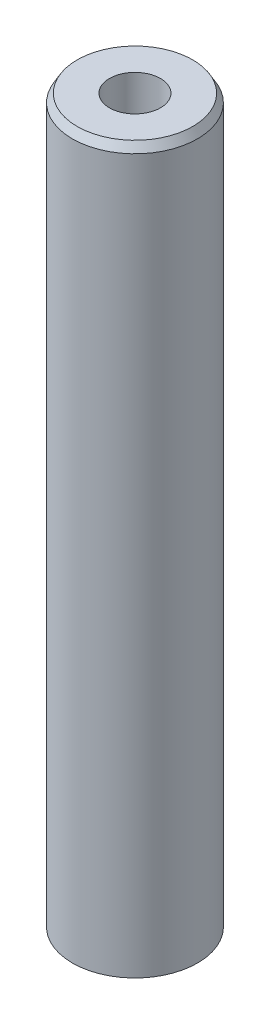
ISO-10303-21;
HEADER;
FILE_DESCRIPTION(('STEP AP214'),'2;1');
FILE_NAME('part.step','',(''),(''),'','','');
FILE_SCHEMA(('AUTOMOTIVE_DESIGN { 1 0 10303 214 1 1 1 1 }'));
ENDSEC;
DATA;
#1=APPLICATION_CONTEXT('core data for automotive mechanical design processes');
#2=APPLICATION_PROTOCOL_DEFINITION('international standard','automotive_design',2000,#1);
#3=PRODUCT_CONTEXT('',#1,'mechanical');
#4=PRODUCT('Part','Part','',(#3));
#5=PRODUCT_RELATED_PRODUCT_CATEGORY('part','',(#4));
#6=PRODUCT_DEFINITION_FORMATION('','',#4);
#7=PRODUCT_DEFINITION_CONTEXT('part definition',#1,'design');
#8=PRODUCT_DEFINITION('design','',#6,#7);
#9=PRODUCT_DEFINITION_SHAPE('','',#8);
#10=(LENGTH_UNIT() NAMED_UNIT(*) SI_UNIT(.MILLI.,.METRE.));
#11=(NAMED_UNIT(*) PLANE_ANGLE_UNIT() SI_UNIT($,.RADIAN.));
#12=(NAMED_UNIT(*) SI_UNIT($,.STERADIAN.) SOLID_ANGLE_UNIT());
#13=UNCERTAINTY_MEASURE_WITH_UNIT(LENGTH_MEASURE(1.E-05),#10,'distance_accuracy_value','');
#14=(GEOMETRIC_REPRESENTATION_CONTEXT(3) GLOBAL_UNCERTAINTY_ASSIGNED_CONTEXT((#13)) GLOBAL_UNIT_ASSIGNED_CONTEXT((#10,
#11,#12)) REPRESENTATION_CONTEXT('',''));
#15=CARTESIAN_POINT('',(0.,0.,0.));
#16=DIRECTION('',(0.,0.,1.));
#17=DIRECTION('',(1.,0.,0.));
#18=AXIS2_PLACEMENT_3D('',#15,#16,#17);
#19=CARTESIAN_POINT('',(0.,203.347318659186,0.));
#20=DIRECTION('',(0.,-1.,0.));
#21=DIRECTION('',(0.,0.,-1.));
#22=AXIS2_PLACEMENT_3D('',#19,#20,#21);
#23=CYLINDRICAL_SURFACE('',#22,17.5);
#24=CARTESIAN_POINT('',(0.,201.023777022342,0.));
#25=DIRECTION('',(0.,1.,0.));
#26=DIRECTION('',(0.,0.,1.));
#27=AXIS2_PLACEMENT_3D('',#24,#25,#26);
#28=CIRCLE('',#27,17.5);
#29=CARTESIAN_POINT('',(0.,201.023777022342,17.5));
#30=VERTEX_POINT('',#29);
#31=EDGE_CURVE('E50',#30,#30,#28,.F.);
#32=ORIENTED_EDGE('',*,*,#31,.T.);
#33=EDGE_LOOP('',(#32));
#34=FACE_BOUND('',#33,.T.);
#35=CARTESIAN_POINT('',(0.,1.34149738950504,0.));
#36=DIRECTION('',(0.,1.,0.));
#37=DIRECTION('',(0.,0.,1.));
#38=AXIS2_PLACEMENT_3D('',#35,#36,#37);
#39=CIRCLE('',#38,17.5);
#40=CARTESIAN_POINT('',(0.,1.34149738950504,17.5));
#41=VERTEX_POINT('',#40);
#42=EDGE_CURVE('E51',#41,#41,#39,.T.);
#43=ORIENTED_EDGE('',*,*,#42,.T.);
#44=EDGE_LOOP('',(#43));
#45=FACE_BOUND('',#44,.T.);
#46=ADVANCED_FACE('F39',(#34,#45),#23,.T.);
#47=CARTESIAN_POINT('',(0.,203.347318659186,0.));
#48=DIRECTION('',(0.,1.,0.));
#49=DIRECTION('',(0.,0.,1.));
#50=AXIS2_PLACEMENT_3D('',#47,#48,#49);
#51=PLANE('',#50);
#52=CARTESIAN_POINT('',(0.,203.347318659186,0.));
#53=DIRECTION('',(0.,1.,0.));
#54=DIRECTION('',(0.,0.,1.));
#55=AXIS2_PLACEMENT_3D('',#52,#53,#54);
#56=CIRCLE('',#55,16.158502610495);
#57=CARTESIAN_POINT('',(0.,203.347318659186,16.158502610495));
#58=VERTEX_POINT('',#57);
#59=EDGE_CURVE('E54',#58,#58,#56,.T.);
#60=ORIENTED_EDGE('',*,*,#59,.T.);
#61=EDGE_LOOP('',(#60));
#62=FACE_BOUND('',#61,.T.);
#63=CARTESIAN_POINT('',(0.,203.347318659186,0.));
#64=DIRECTION('',(0.,1.,0.));
#65=DIRECTION('',(0.,0.,1.));
#66=AXIS2_PLACEMENT_3D('',#63,#64,#65);
#67=CIRCLE('',#66,7.13083702076861);
#68=CARTESIAN_POINT('',(0.,203.347318659186,7.13083702076861));
#69=VERTEX_POINT('',#68);
#70=EDGE_CURVE('E58',#69,#69,#67,.T.);
#71=ORIENTED_EDGE('',*,*,#70,.F.);
#72=EDGE_LOOP('',(#71));
#73=FACE_BOUND('',#72,.T.);
#74=ADVANCED_FACE('F69',(#62,#73),#51,.T.);
#75=CARTESIAN_POINT('',(0.,0.,0.));
#76=DIRECTION('',(0.,1.,0.));
#77=DIRECTION('',(0.,0.,1.));
#78=AXIS2_PLACEMENT_3D('',#75,#76,#77);
#79=PLANE('',#78);
#80=CARTESIAN_POINT('',(0.,0.,0.));
#81=DIRECTION('',(0.,1.,0.));
#82=DIRECTION('',(0.,0.,1.));
#83=AXIS2_PLACEMENT_3D('',#80,#81,#82);
#84=CIRCLE('',#83,15.1764583631563);
#85=CARTESIAN_POINT('',(0.,0.,15.1764583631563));
#86=VERTEX_POINT('',#85);
#87=EDGE_CURVE('E10',#86,#86,#84,.F.);
#88=ORIENTED_EDGE('',*,*,#87,.T.);
#89=EDGE_LOOP('',(#88));
#90=FACE_BOUND('',#89,.T.);
#91=CARTESIAN_POINT('',(0.,0.,0.));
#92=DIRECTION('',(0.,1.,0.));
#93=DIRECTION('',(0.,0.,1.));
#94=AXIS2_PLACEMENT_3D('',#91,#92,#93);
#95=CIRCLE('',#94,7.13083702076861);
#96=CARTESIAN_POINT('',(0.,0.,7.13083702076861));
#97=VERTEX_POINT('',#96);
#98=EDGE_CURVE('E63',#97,#97,#95,.T.);
#99=ORIENTED_EDGE('',*,*,#98,.T.);
#100=EDGE_LOOP('',(#99));
#101=FACE_BOUND('',#100,.T.);
#102=ADVANCED_FACE('F75',(#90,#101),#79,.F.);
#103=CARTESIAN_POINT('',(0.,203.347318659186,0.));
#104=DIRECTION('',(0.,-1.,0.));
#105=DIRECTION('',(0.,0.,-1.));
#106=AXIS2_PLACEMENT_3D('',#103,#104,#105);
#107=CYLINDRICAL_SURFACE('',#106,7.13083702076861);
#108=ORIENTED_EDGE('',*,*,#70,.T.);
#109=EDGE_LOOP('',(#108));
#110=FACE_BOUND('',#109,.T.);
#111=ORIENTED_EDGE('',*,*,#98,.F.);
#112=EDGE_LOOP('',(#111));
#113=FACE_BOUND('',#112,.T.);
#114=ADVANCED_FACE('F70',(#110,#113),#107,.F.);
#115=CARTESIAN_POINT('',(0.,203.347318659186,0.));
#116=DIRECTION('',(0.,-1.,0.));
#117=DIRECTION('',(0.,0.,-1.));
#118=AXIS2_PLACEMENT_3D('',#115,#116,#117);
#119=CONICAL_SURFACE('',#118,16.158502610495,0.523598775598293);
#120=ORIENTED_EDGE('',*,*,#31,.F.);
#121=EDGE_LOOP('',(#120));
#122=FACE_BOUND('',#121,.T.);
#123=ORIENTED_EDGE('',*,*,#59,.F.);
#124=EDGE_LOOP('',(#123));
#125=FACE_BOUND('',#124,.T.);
#126=ADVANCED_FACE('F81',(#122,#125),#119,.T.);
#127=CARTESIAN_POINT('',(0.,1.34149738950504,0.));
#128=DIRECTION('',(0.,1.,0.));
#129=DIRECTION('',(0.,0.,1.));
#130=AXIS2_PLACEMENT_3D('',#127,#128,#129);
#131=CONICAL_SURFACE('',#130,17.5,1.0471975511966);
#132=ORIENTED_EDGE('',*,*,#87,.F.);
#133=EDGE_LOOP('',(#132));
#134=FACE_BOUND('',#133,.T.);
#135=ORIENTED_EDGE('',*,*,#42,.F.);
#136=EDGE_LOOP('',(#135));
#137=FACE_BOUND('',#136,.T.);
#138=ADVANCED_FACE('F45',(#134,#137),#131,.T.);
#139=CLOSED_SHELL('',(#46,#74,#102,#114,#126,#138));
#140=MANIFOLD_SOLID_BREP('B2',#139);
#141=ADVANCED_BREP_SHAPE_REPRESENTATION('',(#18,#140),#14);
#142=SHAPE_DEFINITION_REPRESENTATION(#9,#141);
ENDSEC;
END-ISO-10303-21;
